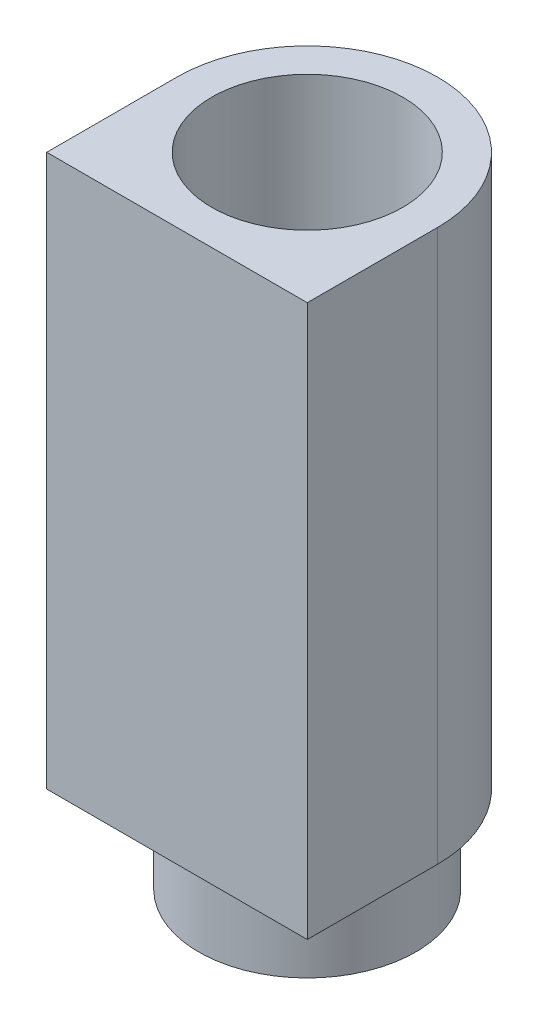
ISO-10303-21;
HEADER;
FILE_DESCRIPTION(('STEP AP214'),'2;1');
FILE_NAME('part.step','',(''),(''),'','','');
FILE_SCHEMA(('AUTOMOTIVE_DESIGN { 1 0 10303 214 1 1 1 1 }'));
ENDSEC;
DATA;
#1=APPLICATION_CONTEXT('core data for automotive mechanical design processes');
#2=APPLICATION_PROTOCOL_DEFINITION('international standard','automotive_design',2000,#1);
#3=PRODUCT_CONTEXT('',#1,'mechanical');
#4=PRODUCT('Part','Part','',(#3));
#5=PRODUCT_RELATED_PRODUCT_CATEGORY('part','',(#4));
#6=PRODUCT_DEFINITION_FORMATION('','',#4);
#7=PRODUCT_DEFINITION_CONTEXT('part definition',#1,'design');
#8=PRODUCT_DEFINITION('design','',#6,#7);
#9=PRODUCT_DEFINITION_SHAPE('','',#8);
#10=(LENGTH_UNIT() NAMED_UNIT(*) SI_UNIT(.MILLI.,.METRE.));
#11=(NAMED_UNIT(*) PLANE_ANGLE_UNIT() SI_UNIT($,.RADIAN.));
#12=(NAMED_UNIT(*) SI_UNIT($,.STERADIAN.) SOLID_ANGLE_UNIT());
#13=UNCERTAINTY_MEASURE_WITH_UNIT(LENGTH_MEASURE(1.E-05),#10,'distance_accuracy_value','');
#14=(GEOMETRIC_REPRESENTATION_CONTEXT(3) GLOBAL_UNCERTAINTY_ASSIGNED_CONTEXT((#13)) GLOBAL_UNIT_ASSIGNED_CONTEXT((#10,
#11,#12)) REPRESENTATION_CONTEXT('',''));
#15=CARTESIAN_POINT('',(0.,0.,0.));
#16=DIRECTION('',(0.,0.,1.));
#17=DIRECTION('',(1.,0.,0.));
#18=AXIS2_PLACEMENT_3D('',#15,#16,#17);
#19=CARTESIAN_POINT('',(30.,127.,0.));
#20=DIRECTION('',(-1.,0.,0.));
#21=DIRECTION('',(0.,0.,1.));
#22=AXIS2_PLACEMENT_3D('',#19,#20,#21);
#23=PLANE('',#22);
#24=DIRECTION('',(0.,0.,-1.));
#25=VECTOR('',#24,1.);
#26=CARTESIAN_POINT('',(30.,0.,0.));
#27=LINE('',#26,#25);
#28=CARTESIAN_POINT('',(30.,0.,30.));
#29=VERTEX_POINT('',#28);
#30=CARTESIAN_POINT('',(30.,0.,0.));
#31=VERTEX_POINT('',#30);
#32=EDGE_CURVE('E99',#29,#31,#27,.T.);
#33=ORIENTED_EDGE('',*,*,#32,.T.);
#34=DIRECTION('',(0.,-1.,0.));
#35=VECTOR('',#34,1.);
#36=CARTESIAN_POINT('',(30.,127.,0.));
#37=LINE('',#36,#35);
#38=CARTESIAN_POINT('',(30.,127.,0.));
#39=VERTEX_POINT('',#38);
#40=EDGE_CURVE('E36',#39,#31,#37,.T.);
#41=ORIENTED_EDGE('',*,*,#40,.F.);
#42=DIRECTION('',(0.,0.,-1.));
#43=VECTOR('',#42,1.);
#44=CARTESIAN_POINT('',(30.,127.,0.));
#45=LINE('',#44,#43);
#46=CARTESIAN_POINT('',(30.,127.,30.));
#47=VERTEX_POINT('',#46);
#48=EDGE_CURVE('E86',#47,#39,#45,.T.);
#49=ORIENTED_EDGE('',*,*,#48,.F.);
#50=DIRECTION('',(0.,-1.,0.));
#51=VECTOR('',#50,1.);
#52=CARTESIAN_POINT('',(30.,127.,30.));
#53=LINE('',#52,#51);
#54=EDGE_CURVE('E95',#47,#29,#53,.T.);
#55=ORIENTED_EDGE('',*,*,#54,.T.);
#56=EDGE_LOOP('',(#33,#41,#49,#55));
#57=FACE_BOUND('',#56,.T.);
#58=ADVANCED_FACE('F33',(#57),#23,.F.);
#59=CARTESIAN_POINT('',(0.,127.,0.));
#60=DIRECTION('',(0.,-1.,0.));
#61=DIRECTION('',(0.,0.,-1.));
#62=AXIS2_PLACEMENT_3D('',#59,#60,#61);
#63=CYLINDRICAL_SURFACE('',#62,30.);
#64=CARTESIAN_POINT('',(0.,0.,0.));
#65=DIRECTION('',(0.,1.,0.));
#66=DIRECTION('',(0.,0.,1.));
#67=AXIS2_PLACEMENT_3D('',#64,#65,#66);
#68=CIRCLE('',#67,30.);
#69=CARTESIAN_POINT('',(-30.,0.,0.));
#70=VERTEX_POINT('',#69);
#71=EDGE_CURVE('E91',#31,#70,#68,.T.);
#72=ORIENTED_EDGE('',*,*,#71,.T.);
#73=DIRECTION('',(0.,-1.,0.));
#74=VECTOR('',#73,1.);
#75=CARTESIAN_POINT('',(-30.,127.,0.));
#76=LINE('',#75,#74);
#77=CARTESIAN_POINT('',(-30.,127.,0.));
#78=VERTEX_POINT('',#77);
#79=EDGE_CURVE('E89',#78,#70,#76,.T.);
#80=ORIENTED_EDGE('',*,*,#79,.F.);
#81=CARTESIAN_POINT('',(0.,127.,0.));
#82=DIRECTION('',(0.,1.,0.));
#83=DIRECTION('',(0.,0.,1.));
#84=AXIS2_PLACEMENT_3D('',#81,#82,#83);
#85=CIRCLE('',#84,30.);
#86=EDGE_CURVE('E81',#39,#78,#85,.T.);
#87=ORIENTED_EDGE('',*,*,#86,.F.);
#88=ORIENTED_EDGE('',*,*,#40,.T.);
#89=EDGE_LOOP('',(#72,#80,#87,#88));
#90=FACE_BOUND('',#89,.T.);
#91=ADVANCED_FACE('F90',(#90),#63,.T.);
#92=CARTESIAN_POINT('',(-30.,127.,0.));
#93=DIRECTION('',(1.,0.,0.));
#94=DIRECTION('',(0.,0.,-1.));
#95=AXIS2_PLACEMENT_3D('',#92,#93,#94);
#96=PLANE('',#95);
#97=DIRECTION('',(0.,0.,1.));
#98=VECTOR('',#97,1.);
#99=CARTESIAN_POINT('',(-30.,0.,0.));
#100=LINE('',#99,#98);
#101=CARTESIAN_POINT('',(-30.,0.,30.));
#102=VERTEX_POINT('',#101);
#103=EDGE_CURVE('E67',#70,#102,#100,.T.);
#104=ORIENTED_EDGE('',*,*,#103,.T.);
#105=DIRECTION('',(0.,-1.,0.));
#106=VECTOR('',#105,1.);
#107=CARTESIAN_POINT('',(-30.,127.,30.));
#108=LINE('',#107,#106);
#109=CARTESIAN_POINT('',(-30.,127.,30.));
#110=VERTEX_POINT('',#109);
#111=EDGE_CURVE('E92',#110,#102,#108,.T.);
#112=ORIENTED_EDGE('',*,*,#111,.F.);
#113=DIRECTION('',(0.,0.,1.));
#114=VECTOR('',#113,1.);
#115=CARTESIAN_POINT('',(-30.,127.,0.));
#116=LINE('',#115,#114);
#117=EDGE_CURVE('E84',#78,#110,#116,.T.);
#118=ORIENTED_EDGE('',*,*,#117,.F.);
#119=ORIENTED_EDGE('',*,*,#79,.T.);
#120=EDGE_LOOP('',(#104,#112,#118,#119));
#121=FACE_BOUND('',#120,.T.);
#122=ADVANCED_FACE('F93',(#121),#96,.F.);
#123=CARTESIAN_POINT('',(-30.,127.,30.));
#124=DIRECTION('',(0.,0.,-1.));
#125=DIRECTION('',(-1.,0.,0.));
#126=AXIS2_PLACEMENT_3D('',#123,#124,#125);
#127=PLANE('',#126);
#128=DIRECTION('',(1.,0.,0.));
#129=VECTOR('',#128,1.);
#130=CARTESIAN_POINT('',(-30.,0.,30.));
#131=LINE('',#130,#129);
#132=EDGE_CURVE('E73',#102,#29,#131,.T.);
#133=ORIENTED_EDGE('',*,*,#132,.T.);
#134=ORIENTED_EDGE('',*,*,#54,.F.);
#135=DIRECTION('',(1.,0.,0.));
#136=VECTOR('',#135,1.);
#137=CARTESIAN_POINT('',(-30.,127.,30.));
#138=LINE('',#137,#136);
#139=EDGE_CURVE('E50',#110,#47,#138,.T.);
#140=ORIENTED_EDGE('',*,*,#139,.F.);
#141=ORIENTED_EDGE('',*,*,#111,.T.);
#142=EDGE_LOOP('',(#133,#134,#140,#141));
#143=FACE_BOUND('',#142,.T.);
#144=ADVANCED_FACE('F107',(#143),#127,.F.);
#145=CARTESIAN_POINT('',(0.,127.,0.));
#146=DIRECTION('',(0.,1.,0.));
#147=DIRECTION('',(0.,0.,1.));
#148=AXIS2_PLACEMENT_3D('',#145,#146,#147);
#149=PLANE('',#148);
#150=CARTESIAN_POINT('',(0.,127.,0.));
#151=DIRECTION('',(0.,-1.,0.));
#152=DIRECTION('',(0.,0.,-1.));
#153=AXIS2_PLACEMENT_3D('',#150,#151,#152);
#154=CIRCLE('',#153,22.);
#155=CARTESIAN_POINT('',(0.,127.,-22.));
#156=VERTEX_POINT('',#155);
#157=EDGE_CURVE('E115',#156,#156,#154,.T.);
#158=ORIENTED_EDGE('',*,*,#157,.T.);
#159=EDGE_LOOP('',(#158));
#160=FACE_BOUND('',#159,.T.);
#161=ORIENTED_EDGE('',*,*,#48,.T.);
#162=ORIENTED_EDGE('',*,*,#86,.T.);
#163=ORIENTED_EDGE('',*,*,#117,.T.);
#164=ORIENTED_EDGE('',*,*,#139,.T.);
#165=EDGE_LOOP('',(#161,#162,#163,#164));
#166=FACE_BOUND('',#165,.T.);
#167=ADVANCED_FACE('F82',(#160,#166),#149,.T.);
#168=CARTESIAN_POINT('',(0.,0.,0.));
#169=DIRECTION('',(0.,1.,0.));
#170=DIRECTION('',(0.,0.,1.));
#171=AXIS2_PLACEMENT_3D('',#168,#169,#170);
#172=PLANE('',#171);
#173=CARTESIAN_POINT('',(0.,0.,0.));
#174=DIRECTION('',(0.,-1.,0.));
#175=DIRECTION('',(0.,0.,-1.));
#176=AXIS2_PLACEMENT_3D('',#173,#174,#175);
#177=CIRCLE('',#176,25.);
#178=CARTESIAN_POINT('',(0.,0.,-25.));
#179=VERTEX_POINT('',#178);
#180=EDGE_CURVE('E11',#179,#179,#177,.T.);
#181=ORIENTED_EDGE('',*,*,#180,.F.);
#182=EDGE_LOOP('',(#181));
#183=FACE_BOUND('',#182,.T.);
#184=ORIENTED_EDGE('',*,*,#32,.F.);
#185=ORIENTED_EDGE('',*,*,#132,.F.);
#186=ORIENTED_EDGE('',*,*,#103,.F.);
#187=ORIENTED_EDGE('',*,*,#71,.F.);
#188=EDGE_LOOP('',(#184,#185,#186,#187));
#189=FACE_BOUND('',#188,.T.);
#190=ADVANCED_FACE('F110',(#183,#189),#172,.F.);
#191=CARTESIAN_POINT('',(0.,-20.,0.));
#192=DIRECTION('',(0.,1.,0.));
#193=DIRECTION('',(0.,0.,1.));
#194=AXIS2_PLACEMENT_3D('',#191,#192,#193);
#195=CYLINDRICAL_SURFACE('',#194,25.);
#196=CARTESIAN_POINT('',(0.,-20.,0.));
#197=DIRECTION('',(0.,-1.,0.));
#198=DIRECTION('',(0.,0.,-1.));
#199=AXIS2_PLACEMENT_3D('',#196,#197,#198);
#200=CIRCLE('',#199,25.);
#201=CARTESIAN_POINT('',(0.,-20.,-25.));
#202=VERTEX_POINT('',#201);
#203=EDGE_CURVE('E102',#202,#202,#200,.T.);
#204=ORIENTED_EDGE('',*,*,#203,.F.);
#205=EDGE_LOOP('',(#204));
#206=FACE_BOUND('',#205,.T.);
#207=ORIENTED_EDGE('',*,*,#180,.T.);
#208=EDGE_LOOP('',(#207));
#209=FACE_BOUND('',#208,.T.);
#210=ADVANCED_FACE('F132',(#206,#209),#195,.T.);
#211=CARTESIAN_POINT('',(0.,-20.,0.));
#212=DIRECTION('',(0.,-1.,0.));
#213=DIRECTION('',(0.,0.,-1.));
#214=AXIS2_PLACEMENT_3D('',#211,#212,#213);
#215=PLANE('',#214);
#216=CARTESIAN_POINT('',(0.,-20.,0.));
#217=DIRECTION('',(0.,-1.,0.));
#218=DIRECTION('',(0.,0.,-1.));
#219=AXIS2_PLACEMENT_3D('',#216,#217,#218);
#220=CIRCLE('',#219,22.);
#221=CARTESIAN_POINT('',(0.,-20.,-22.));
#222=VERTEX_POINT('',#221);
#223=EDGE_CURVE('E116',#222,#222,#220,.T.);
#224=ORIENTED_EDGE('',*,*,#223,.F.);
#225=EDGE_LOOP('',(#224));
#226=FACE_BOUND('',#225,.T.);
#227=ORIENTED_EDGE('',*,*,#203,.T.);
#228=EDGE_LOOP('',(#227));
#229=FACE_BOUND('',#228,.T.);
#230=ADVANCED_FACE('F126',(#226,#229),#215,.T.);
#231=CARTESIAN_POINT('',(0.,127.,0.));
#232=DIRECTION('',(0.,-1.,0.));
#233=DIRECTION('',(0.,0.,-1.));
#234=AXIS2_PLACEMENT_3D('',#231,#232,#233);
#235=CYLINDRICAL_SURFACE('',#234,22.);
#236=ORIENTED_EDGE('',*,*,#157,.F.);
#237=EDGE_LOOP('',(#236));
#238=FACE_BOUND('',#237,.T.);
#239=ORIENTED_EDGE('',*,*,#223,.T.);
#240=EDGE_LOOP('',(#239));
#241=FACE_BOUND('',#240,.T.);
#242=ADVANCED_FACE('F123',(#238,#241),#235,.F.);
#243=CLOSED_SHELL('',(#58,#91,#122,#144,#167,#190,#210,#230,#242));
#244=MANIFOLD_SOLID_BREP('B2',#243);
#245=ADVANCED_BREP_SHAPE_REPRESENTATION('',(#18,#244),#14);
#246=SHAPE_DEFINITION_REPRESENTATION(#9,#245);
ENDSEC;
END-ISO-10303-21;
